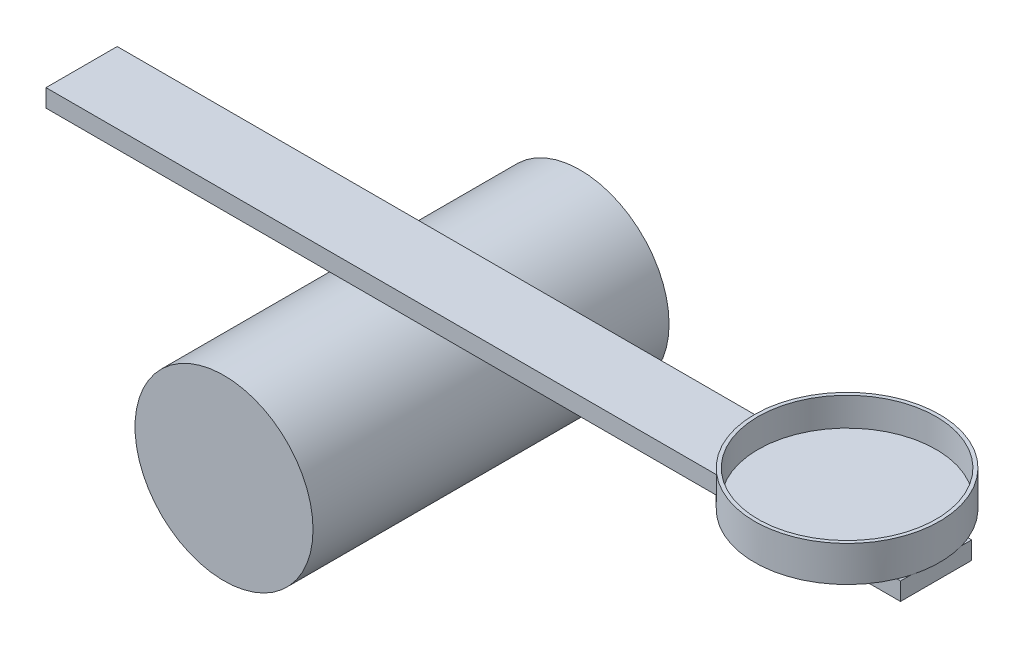
ISO-10303-21;
HEADER;
FILE_DESCRIPTION(('STEP AP214'),'2;1');
FILE_NAME('part.step','',(''),(''),'','','');
FILE_SCHEMA(('AUTOMOTIVE_DESIGN { 1 0 10303 214 1 1 1 1 }'));
ENDSEC;
DATA;
#1=APPLICATION_CONTEXT('core data for automotive mechanical design processes');
#2=APPLICATION_PROTOCOL_DEFINITION('international standard','automotive_design',2000,#1);
#3=PRODUCT_CONTEXT('',#1,'mechanical');
#4=PRODUCT('Part','Part','',(#3));
#5=PRODUCT_RELATED_PRODUCT_CATEGORY('part','',(#4));
#6=PRODUCT_DEFINITION_FORMATION('','',#4);
#7=PRODUCT_DEFINITION_CONTEXT('part definition',#1,'design');
#8=PRODUCT_DEFINITION('design','',#6,#7);
#9=PRODUCT_DEFINITION_SHAPE('','',#8);
#10=(LENGTH_UNIT() NAMED_UNIT(*) SI_UNIT(.MILLI.,.METRE.));
#11=(NAMED_UNIT(*) PLANE_ANGLE_UNIT() SI_UNIT($,.RADIAN.));
#12=(NAMED_UNIT(*) SI_UNIT($,.STERADIAN.) SOLID_ANGLE_UNIT());
#13=UNCERTAINTY_MEASURE_WITH_UNIT(LENGTH_MEASURE(1.E-05),#10,'distance_accuracy_value','');
#14=(GEOMETRIC_REPRESENTATION_CONTEXT(3) GLOBAL_UNCERTAINTY_ASSIGNED_CONTEXT((#13)) GLOBAL_UNIT_ASSIGNED_CONTEXT((#10,
#11,#12)) REPRESENTATION_CONTEXT('',''));
#15=CARTESIAN_POINT('',(0.,0.,0.));
#16=DIRECTION('',(0.,0.,1.));
#17=DIRECTION('',(1.,0.,0.));
#18=AXIS2_PLACEMENT_3D('',#15,#16,#17);
#19=CARTESIAN_POINT('',(0.,0.,25.4));
#20=DIRECTION('',(0.,0.,1.));
#21=DIRECTION('',(1.,0.,0.));
#22=AXIS2_PLACEMENT_3D('',#19,#20,#21);
#23=PLANE('',#22);
#24=DIRECTION('',(-1.,0.,0.));
#25=VECTOR('',#24,1.);
#26=CARTESIAN_POINT('',(0.,38.1,25.4));
#27=LINE('',#26,#25);
#28=CARTESIAN_POINT('',(189.23,38.1,25.4));
#29=VERTEX_POINT('',#28);
#30=CARTESIAN_POINT('',(128.27,38.1,25.4));
#31=VERTEX_POINT('',#30);
#32=EDGE_CURVE('E143',#29,#31,#27,.T.);
#33=ORIENTED_EDGE('',*,*,#32,.T.);
#34=CARTESIAN_POINT('',(-114.3,38.1,25.4));
#35=VERTEX_POINT('',#34);
#36=EDGE_CURVE('E127',#31,#35,#27,.T.);
#37=ORIENTED_EDGE('',*,*,#36,.T.);
#38=DIRECTION('',(0.,-1.,0.));
#39=VECTOR('',#38,1.);
#40=CARTESIAN_POINT('',(-114.3,-2.49800180540662E-13,25.4));
#41=LINE('',#40,#39);
#42=CARTESIAN_POINT('',(-114.3,31.75,25.4));
#43=VERTEX_POINT('',#42);
#44=EDGE_CURVE('E119',#35,#43,#41,.T.);
#45=ORIENTED_EDGE('',*,*,#44,.T.);
#46=DIRECTION('',(1.,0.,0.));
#47=VECTOR('',#46,1.);
#48=CARTESIAN_POINT('',(0.,31.75,25.4));
#49=LINE('',#48,#47);
#50=CARTESIAN_POINT('',(190.5,31.75,25.4));
#51=VERTEX_POINT('',#50);
#52=EDGE_CURVE('E145',#43,#51,#49,.T.);
#53=ORIENTED_EDGE('',*,*,#52,.T.);
#54=DIRECTION('',(0.,1.,0.));
#55=VECTOR('',#54,1.);
#56=CARTESIAN_POINT('',(190.5,-8.32667268468868E-13,25.4));
#57=LINE('',#56,#55);
#58=CARTESIAN_POINT('',(190.5,38.1,25.4));
#59=VERTEX_POINT('',#58);
#60=EDGE_CURVE('E142',#51,#59,#57,.T.);
#61=ORIENTED_EDGE('',*,*,#60,.T.);
#62=EDGE_CURVE('E139',#59,#29,#27,.T.);
#63=ORIENTED_EDGE('',*,*,#62,.T.);
#64=EDGE_LOOP('',(#33,#37,#45,#53,#61,#63));
#65=FACE_BOUND('',#64,.T.);
#66=ADVANCED_FACE('F46',(#65),#23,.T.);
#67=CARTESIAN_POINT('',(0.,0.,0.));
#68=DIRECTION('',(0.,0.,1.));
#69=DIRECTION('',(1.,0.,0.));
#70=AXIS2_PLACEMENT_3D('',#67,#68,#69);
#71=PLANE('',#70);
#72=DIRECTION('',(-1.,0.,0.));
#73=VECTOR('',#72,1.);
#74=CARTESIAN_POINT('',(0.,38.1,0.));
#75=LINE('',#74,#73);
#76=CARTESIAN_POINT('',(128.27,38.1,0.));
#77=VERTEX_POINT('',#76);
#78=CARTESIAN_POINT('',(-114.3,38.1,0.));
#79=VERTEX_POINT('',#78);
#80=EDGE_CURVE('E107',#77,#79,#75,.T.);
#81=ORIENTED_EDGE('',*,*,#80,.F.);
#82=CARTESIAN_POINT('',(189.23,38.1,0.));
#83=VERTEX_POINT('',#82);
#84=EDGE_CURVE('E118',#83,#77,#75,.T.);
#85=ORIENTED_EDGE('',*,*,#84,.F.);
#86=CARTESIAN_POINT('',(190.5,38.1,0.));
#87=VERTEX_POINT('',#86);
#88=EDGE_CURVE('E121',#87,#83,#75,.T.);
#89=ORIENTED_EDGE('',*,*,#88,.F.);
#90=DIRECTION('',(0.,1.,0.));
#91=VECTOR('',#90,1.);
#92=CARTESIAN_POINT('',(190.5,-8.32667268468868E-13,0.));
#93=LINE('',#92,#91);
#94=CARTESIAN_POINT('',(190.5,31.75,0.));
#95=VERTEX_POINT('',#94);
#96=EDGE_CURVE('E135',#95,#87,#93,.T.);
#97=ORIENTED_EDGE('',*,*,#96,.F.);
#98=DIRECTION('',(1.,0.,0.));
#99=VECTOR('',#98,1.);
#100=CARTESIAN_POINT('',(0.,31.75,0.));
#101=LINE('',#100,#99);
#102=CARTESIAN_POINT('',(-114.3,31.75,0.));
#103=VERTEX_POINT('',#102);
#104=EDGE_CURVE('E132',#103,#95,#101,.T.);
#105=ORIENTED_EDGE('',*,*,#104,.F.);
#106=DIRECTION('',(0.,-1.,0.));
#107=VECTOR('',#106,1.);
#108=CARTESIAN_POINT('',(-114.3,-2.49800180540662E-13,0.));
#109=LINE('',#108,#107);
#110=EDGE_CURVE('E53',#79,#103,#109,.T.);
#111=ORIENTED_EDGE('',*,*,#110,.F.);
#112=EDGE_LOOP('',(#81,#85,#89,#97,#105,#111));
#113=FACE_BOUND('',#112,.T.);
#114=ADVANCED_FACE('F130',(#113),#71,.F.);
#115=CARTESIAN_POINT('',(0.,38.1,25.4));
#116=DIRECTION('',(0.,-1.,0.));
#117=DIRECTION('',(1.,0.,0.));
#118=AXIS2_PLACEMENT_3D('',#115,#116,#117);
#119=PLANE('',#118);
#120=CARTESIAN_POINT('',(158.75,38.1,12.7));
#121=DIRECTION('',(0.,1.,0.));
#122=DIRECTION('',(-1.,0.,0.));
#123=AXIS2_PLACEMENT_3D('',#120,#121,#122);
#124=CIRCLE('',#123,33.02);
#125=EDGE_CURVE('E114',#77,#31,#124,.T.);
#126=ORIENTED_EDGE('',*,*,#125,.F.);
#127=ORIENTED_EDGE('',*,*,#80,.T.);
#128=DIRECTION('',(0.,0.,-1.));
#129=VECTOR('',#128,1.);
#130=CARTESIAN_POINT('',(-114.3,38.1,25.4));
#131=LINE('',#130,#129);
#132=EDGE_CURVE('E111',#35,#79,#131,.T.);
#133=ORIENTED_EDGE('',*,*,#132,.F.);
#134=ORIENTED_EDGE('',*,*,#36,.F.);
#135=EDGE_LOOP('',(#126,#127,#133,#134));
#136=FACE_BOUND('',#135,.T.);
#137=ADVANCED_FACE('F109',(#136),#119,.F.);
#138=CARTESIAN_POINT('',(158.75,38.1,12.7));
#139=DIRECTION('',(0.,1.,0.));
#140=DIRECTION('',(-1.,0.,0.));
#141=AXIS2_PLACEMENT_3D('',#138,#139,#140);
#142=CIRCLE('',#141,33.02);
#143=CARTESIAN_POINT('',(190.5,38.1,21.7696141042494));
#144=VERTEX_POINT('',#143);
#145=EDGE_CURVE('E176',#29,#144,#142,.T.);
#146=ORIENTED_EDGE('',*,*,#145,.F.);
#147=ORIENTED_EDGE('',*,*,#62,.F.);
#148=DIRECTION('',(0.,0.,-1.));
#149=VECTOR('',#148,1.);
#150=CARTESIAN_POINT('',(190.5,38.1,25.4));
#151=LINE('',#150,#149);
#152=EDGE_CURVE('E128',#59,#144,#151,.T.);
#153=ORIENTED_EDGE('',*,*,#152,.T.);
#154=EDGE_LOOP('',(#146,#147,#153));
#155=FACE_BOUND('',#154,.T.);
#156=ADVANCED_FACE('F208',(#155),#119,.F.);
#157=CARTESIAN_POINT('',(0.,31.75,25.4));
#158=DIRECTION('',(0.,1.,0.));
#159=DIRECTION('',(-1.,0.,0.));
#160=AXIS2_PLACEMENT_3D('',#157,#158,#159);
#161=PLANE('',#160);
#162=ORIENTED_EDGE('',*,*,#52,.F.);
#163=DIRECTION('',(0.,0.,-1.));
#164=VECTOR('',#163,1.);
#165=CARTESIAN_POINT('',(-114.3,31.75,25.4));
#166=LINE('',#165,#164);
#167=EDGE_CURVE('E148',#43,#103,#166,.T.);
#168=ORIENTED_EDGE('',*,*,#167,.T.);
#169=ORIENTED_EDGE('',*,*,#104,.T.);
#170=DIRECTION('',(0.,0.,-1.));
#171=VECTOR('',#170,1.);
#172=CARTESIAN_POINT('',(190.5,31.75,25.4));
#173=LINE('',#172,#171);
#174=EDGE_CURVE('E150',#51,#95,#173,.T.);
#175=ORIENTED_EDGE('',*,*,#174,.F.);
#176=EDGE_LOOP('',(#162,#168,#169,#175));
#177=FACE_BOUND('',#176,.T.);
#178=ADVANCED_FACE('F215',(#177),#161,.F.);
#179=CARTESIAN_POINT('',(-114.3,-2.49800180540662E-13,25.4));
#180=DIRECTION('',(1.,0.,0.));
#181=DIRECTION('',(0.,1.,0.));
#182=AXIS2_PLACEMENT_3D('',#179,#180,#181);
#183=PLANE('',#182);
#184=ORIENTED_EDGE('',*,*,#110,.T.);
#185=ORIENTED_EDGE('',*,*,#167,.F.);
#186=ORIENTED_EDGE('',*,*,#44,.F.);
#187=ORIENTED_EDGE('',*,*,#132,.T.);
#188=EDGE_LOOP('',(#184,#185,#186,#187));
#189=FACE_BOUND('',#188,.T.);
#190=ADVANCED_FACE('F124',(#189),#183,.F.);
#191=CARTESIAN_POINT('',(190.5,-8.32667268468868E-13,25.4));
#192=DIRECTION('',(-1.,0.,0.));
#193=DIRECTION('',(0.,-1.,0.));
#194=AXIS2_PLACEMENT_3D('',#191,#192,#193);
#195=PLANE('',#194);
#196=ORIENTED_EDGE('',*,*,#96,.T.);
#197=CARTESIAN_POINT('',(190.5,38.1,3.63038589575063));
#198=VERTEX_POINT('',#197);
#199=EDGE_CURVE('E153',#198,#87,#151,.T.);
#200=ORIENTED_EDGE('',*,*,#199,.F.);
#201=EDGE_CURVE('E60',#144,#198,#151,.T.);
#202=ORIENTED_EDGE('',*,*,#201,.F.);
#203=ORIENTED_EDGE('',*,*,#152,.F.);
#204=ORIENTED_EDGE('',*,*,#60,.F.);
#205=ORIENTED_EDGE('',*,*,#174,.T.);
#206=EDGE_LOOP('',(#196,#200,#202,#203,#204,#205));
#207=FACE_BOUND('',#206,.T.);
#208=ADVANCED_FACE('F161',(#207),#195,.F.);
#209=EDGE_CURVE('E68',#198,#83,#142,.T.);
#210=ORIENTED_EDGE('',*,*,#209,.F.);
#211=ORIENTED_EDGE('',*,*,#199,.T.);
#212=ORIENTED_EDGE('',*,*,#88,.T.);
#213=EDGE_LOOP('',(#210,#211,#212));
#214=FACE_BOUND('',#213,.T.);
#215=ADVANCED_FACE('F164',(#214),#119,.F.);
#216=CARTESIAN_POINT('',(0.,38.1,0.));
#217=DIRECTION('',(0.,1.,0.));
#218=DIRECTION('',(-1.,0.,0.));
#219=AXIS2_PLACEMENT_3D('',#216,#217,#218);
#220=PLANE('',#219);
#221=ORIENTED_EDGE('',*,*,#32,.F.);
#222=EDGE_CURVE('E155',#31,#29,#142,.T.);
#223=ORIENTED_EDGE('',*,*,#222,.F.);
#224=EDGE_LOOP('',(#221,#223));
#225=FACE_BOUND('',#224,.T.);
#226=ADVANCED_FACE('F212',(#225),#220,.F.);
#227=CARTESIAN_POINT('',(158.75,40.64,12.7));
#228=DIRECTION('',(0.,-1.,0.));
#229=DIRECTION('',(1.,0.,0.));
#230=AXIS2_PLACEMENT_3D('',#227,#228,#229);
#231=CYLINDRICAL_SURFACE('',#230,33.02);
#232=ORIENTED_EDGE('',*,*,#125,.T.);
#233=ORIENTED_EDGE('',*,*,#222,.T.);
#234=ORIENTED_EDGE('',*,*,#145,.T.);
#235=EDGE_CURVE('E175',#144,#198,#142,.T.);
#236=ORIENTED_EDGE('',*,*,#235,.T.);
#237=ORIENTED_EDGE('',*,*,#209,.T.);
#238=EDGE_CURVE('E166',#83,#77,#142,.T.);
#239=ORIENTED_EDGE('',*,*,#238,.T.);
#240=EDGE_LOOP('',(#232,#233,#234,#236,#237,#239));
#241=FACE_BOUND('',#240,.T.);
#242=CARTESIAN_POINT('',(158.75,50.8,12.7));
#243=DIRECTION('',(0.,1.,0.));
#244=DIRECTION('',(-1.,0.,0.));
#245=AXIS2_PLACEMENT_3D('',#242,#243,#244);
#246=CIRCLE('',#245,33.02);
#247=CARTESIAN_POINT('',(125.73,50.8,12.7));
#248=VERTEX_POINT('',#247);
#249=EDGE_CURVE('E169',#248,#248,#246,.T.);
#250=ORIENTED_EDGE('',*,*,#249,.F.);
#251=EDGE_LOOP('',(#250));
#252=FACE_BOUND('',#251,.T.);
#253=ADVANCED_FACE('F171',(#241,#252),#231,.T.);
#254=ORIENTED_EDGE('',*,*,#84,.T.);
#255=ORIENTED_EDGE('',*,*,#238,.F.);
#256=EDGE_LOOP('',(#254,#255));
#257=FACE_BOUND('',#256,.T.);
#258=ADVANCED_FACE('F167',(#257),#220,.F.);
#259=CARTESIAN_POINT('',(158.75,38.1,12.7));
#260=DIRECTION('',(0.,1.,0.));
#261=DIRECTION('',(-1.,0.,0.));
#262=AXIS2_PLACEMENT_3D('',#259,#260,#261);
#263=PLANE('',#262);
#264=ORIENTED_EDGE('',*,*,#235,.F.);
#265=ORIENTED_EDGE('',*,*,#201,.T.);
#266=EDGE_LOOP('',(#264,#265));
#267=FACE_BOUND('',#266,.T.);
#268=ADVANCED_FACE('F190',(#267),#263,.F.);
#269=CARTESIAN_POINT('',(158.75,50.8,12.7));
#270=DIRECTION('',(0.,1.,0.));
#271=DIRECTION('',(-1.,0.,0.));
#272=AXIS2_PLACEMENT_3D('',#269,#270,#271);
#273=PLANE('',#272);
#274=ORIENTED_EDGE('',*,*,#249,.T.);
#275=EDGE_LOOP('',(#274));
#276=FACE_BOUND('',#275,.T.);
#277=CARTESIAN_POINT('',(158.75,50.8,12.7));
#278=DIRECTION('',(0.,1.,0.));
#279=DIRECTION('',(-1.,0.,0.));
#280=AXIS2_PLACEMENT_3D('',#277,#278,#279);
#281=CIRCLE('',#280,31.75);
#282=CARTESIAN_POINT('',(127.,50.8,12.7));
#283=VERTEX_POINT('',#282);
#284=EDGE_CURVE('E181',#283,#283,#281,.T.);
#285=ORIENTED_EDGE('',*,*,#284,.F.);
#286=EDGE_LOOP('',(#285));
#287=FACE_BOUND('',#286,.T.);
#288=ADVANCED_FACE('F188',(#276,#287),#273,.T.);
#289=CARTESIAN_POINT('',(158.75,50.8,12.7));
#290=DIRECTION('',(0.,-1.,0.));
#291=DIRECTION('',(1.,0.,0.));
#292=AXIS2_PLACEMENT_3D('',#289,#290,#291);
#293=CYLINDRICAL_SURFACE('',#292,31.75);
#294=ORIENTED_EDGE('',*,*,#284,.T.);
#295=EDGE_LOOP('',(#294));
#296=FACE_BOUND('',#295,.T.);
#297=CARTESIAN_POINT('',(158.75,40.64,12.7));
#298=DIRECTION('',(0.,1.,0.));
#299=DIRECTION('',(-1.,0.,0.));
#300=AXIS2_PLACEMENT_3D('',#297,#298,#299);
#301=CIRCLE('',#300,31.75);
#302=CARTESIAN_POINT('',(127.,40.64,12.7));
#303=VERTEX_POINT('',#302);
#304=EDGE_CURVE('E12',#303,#303,#301,.F.);
#305=ORIENTED_EDGE('',*,*,#304,.T.);
#306=EDGE_LOOP('',(#305));
#307=FACE_BOUND('',#306,.T.);
#308=ADVANCED_FACE('F185',(#296,#307),#293,.F.);
#309=CARTESIAN_POINT('',(0.,40.64,0.));
#310=DIRECTION('',(0.,1.,0.));
#311=DIRECTION('',(-1.,0.,0.));
#312=AXIS2_PLACEMENT_3D('',#309,#310,#311);
#313=PLANE('',#312);
#314=ORIENTED_EDGE('',*,*,#304,.F.);
#315=EDGE_LOOP('',(#314));
#316=FACE_BOUND('',#315,.T.);
#317=ADVANCED_FACE('F197',(#316),#313,.T.);
#318=CLOSED_SHELL('',(#66,#114,#137,#156,#178,#190,#208,#215,#226,#253,#258,#268,#288,#308,#317));
#319=MANIFOLD_SOLID_BREP('B2',#318);
#320=CARTESIAN_POINT('',(0.,0.,76.2));
#321=DIRECTION('',(0.,0.,1.));
#322=DIRECTION('',(1.,0.,0.));
#323=AXIS2_PLACEMENT_3D('',#320,#321,#322);
#324=PLANE('',#323);
#325=CARTESIAN_POINT('',(0.,0.,76.2));
#326=DIRECTION('',(0.,0.,1.));
#327=DIRECTION('',(1.,0.,0.));
#328=AXIS2_PLACEMENT_3D('',#325,#326,#327);
#329=CIRCLE('',#328,31.75);
#330=CARTESIAN_POINT('',(31.75,0.,76.2));
#331=VERTEX_POINT('',#330);
#332=EDGE_CURVE('E379',#331,#331,#329,.T.);
#333=ORIENTED_EDGE('',*,*,#332,.T.);
#334=EDGE_LOOP('',(#333));
#335=FACE_BOUND('',#334,.T.);
#336=ADVANCED_FACE('F372',(#335),#324,.T.);
#337=CARTESIAN_POINT('',(0.,0.,25.4));
#338=DIRECTION('',(0.,0.,-1.));
#339=DIRECTION('',(-1.,0.,0.));
#340=AXIS2_PLACEMENT_3D('',#337,#338,#339);
#341=CYLINDRICAL_SURFACE('',#340,31.75);
#342=CARTESIAN_POINT('',(0.,0.,-50.8));
#343=DIRECTION('',(0.,0.,1.));
#344=DIRECTION('',(1.,0.,0.));
#345=AXIS2_PLACEMENT_3D('',#342,#343,#344);
#346=CIRCLE('',#345,31.75);
#347=CARTESIAN_POINT('',(31.75,0.,-50.8));
#348=VERTEX_POINT('',#347);
#349=EDGE_CURVE('E45',#348,#348,#346,.T.);
#350=ORIENTED_EDGE('',*,*,#349,.T.);
#351=EDGE_LOOP('',(#350));
#352=FACE_BOUND('',#351,.T.);
#353=ORIENTED_EDGE('',*,*,#332,.F.);
#354=EDGE_LOOP('',(#353));
#355=FACE_BOUND('',#354,.T.);
#356=ADVANCED_FACE('F374',(#352,#355),#341,.T.);
#357=CARTESIAN_POINT('',(0.,0.,-50.8));
#358=DIRECTION('',(0.,0.,1.));
#359=DIRECTION('',(1.,0.,0.));
#360=AXIS2_PLACEMENT_3D('',#357,#358,#359);
#361=PLANE('',#360);
#362=ORIENTED_EDGE('',*,*,#349,.F.);
#363=EDGE_LOOP('',(#362));
#364=FACE_BOUND('',#363,.T.);
#365=ADVANCED_FACE('F387',(#364),#361,.F.);
#366=CLOSED_SHELL('',(#336,#356,#365));
#367=MANIFOLD_SOLID_BREP('B6',#366);
#368=ADVANCED_BREP_SHAPE_REPRESENTATION('',(#18,#319,#367),#14);
#369=SHAPE_DEFINITION_REPRESENTATION(#9,#368);
ENDSEC;
END-ISO-10303-21;
